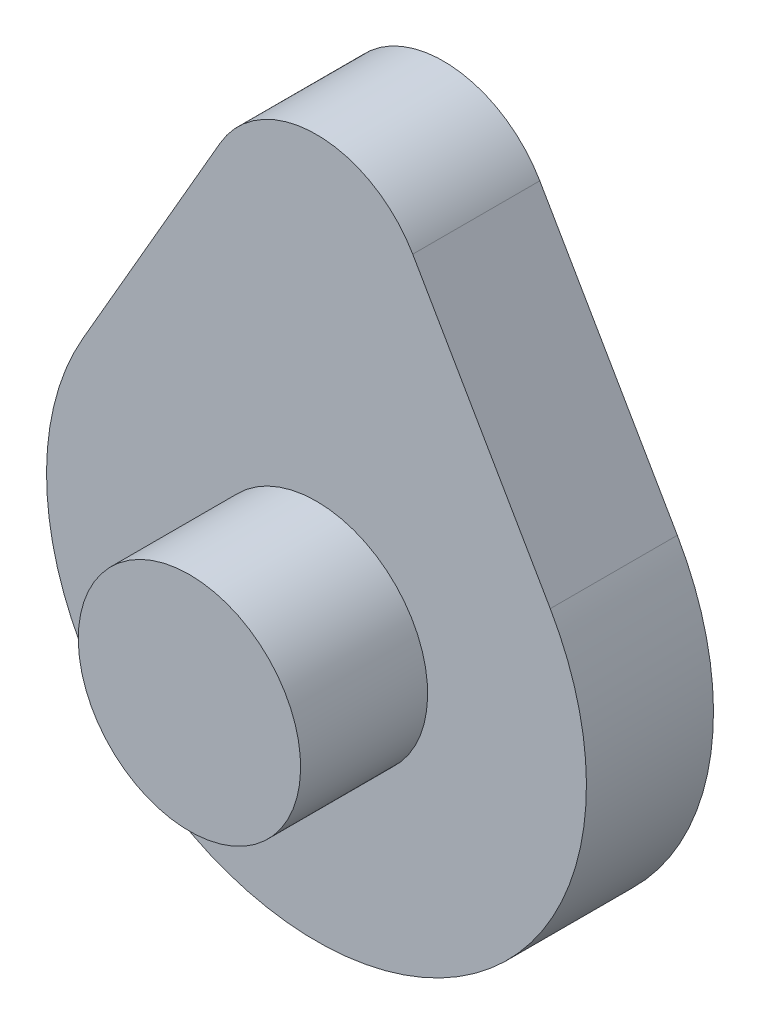
ISO-10303-21;
HEADER;
FILE_DESCRIPTION(('STEP AP214'),'2;1');
FILE_NAME('part.step','',(''),(''),'','','');
FILE_SCHEMA(('AUTOMOTIVE_DESIGN { 1 0 10303 214 1 1 1 1 }'));
ENDSEC;
DATA;
#1=APPLICATION_CONTEXT('core data for automotive mechanical design processes');
#2=APPLICATION_PROTOCOL_DEFINITION('international standard','automotive_design',2000,#1);
#3=PRODUCT_CONTEXT('',#1,'mechanical');
#4=PRODUCT('Part','Part','',(#3));
#5=PRODUCT_RELATED_PRODUCT_CATEGORY('part','',(#4));
#6=PRODUCT_DEFINITION_FORMATION('','',#4);
#7=PRODUCT_DEFINITION_CONTEXT('part definition',#1,'design');
#8=PRODUCT_DEFINITION('design','',#6,#7);
#9=PRODUCT_DEFINITION_SHAPE('','',#8);
#10=(LENGTH_UNIT() NAMED_UNIT(*) SI_UNIT(.MILLI.,.METRE.));
#11=(NAMED_UNIT(*) PLANE_ANGLE_UNIT() SI_UNIT($,.RADIAN.));
#12=(NAMED_UNIT(*) SI_UNIT($,.STERADIAN.) SOLID_ANGLE_UNIT());
#13=UNCERTAINTY_MEASURE_WITH_UNIT(LENGTH_MEASURE(1.E-05),#10,'distance_accuracy_value','');
#14=(GEOMETRIC_REPRESENTATION_CONTEXT(3) GLOBAL_UNCERTAINTY_ASSIGNED_CONTEXT((#13)) GLOBAL_UNIT_ASSIGNED_CONTEXT((#10,
#11,#12)) REPRESENTATION_CONTEXT('',''));
#15=CARTESIAN_POINT('',(0.,0.,0.));
#16=DIRECTION('',(0.,0.,1.));
#17=DIRECTION('',(1.,0.,0.));
#18=AXIS2_PLACEMENT_3D('',#15,#16,#17);
#19=CARTESIAN_POINT('',(-43.01,-43.16,0.));
#20=DIRECTION('',(0.,0.,1.));
#21=DIRECTION('',(1.,0.,0.));
#22=AXIS2_PLACEMENT_3D('',#19,#20,#21);
#23=PLANE('',#22);
#24=DIRECTION('',(0.500000000006738,0.866025403780548,0.));
#25=VECTOR('',#24,1.);
#26=CARTESIAN_POINT('',(-25.9807621135,40.,0.));
#27=LINE('',#26,#25);
#28=CARTESIAN_POINT('',(-36.8060796608972,21.2500000001781,0.));
#29=VERTEX_POINT('',#28);
#30=CARTESIAN_POINT('',(-15.1554445659944,58.7500000000097,0.));
#31=VERTEX_POINT('',#30);
#32=EDGE_CURVE('E81',#29,#31,#27,.T.);
#33=ORIENTED_EDGE('',*,*,#32,.T.);
#34=CARTESIAN_POINT('',(0.,50.,0.));
#35=DIRECTION('',(0.,0.,-1.));
#36=DIRECTION('',(0.,1.,0.));
#37=AXIS2_PLACEMENT_3D('',#34,#35,#36);
#38=CIRCLE('',#37,17.5);
#39=CARTESIAN_POINT('',(15.1554445661455,58.7499999999452,0.));
#40=VERTEX_POINT('',#39);
#41=EDGE_CURVE('E68',#31,#40,#38,.T.);
#42=ORIENTED_EDGE('',*,*,#41,.T.);
#43=DIRECTION('',(0.500000000006738,-0.866025403780548,0.));
#44=VECTOR('',#43,1.);
#45=CARTESIAN_POINT('',(25.9807621135,40.,0.));
#46=LINE('',#45,#44);
#47=CARTESIAN_POINT('',(36.8060796608972,21.2500000001781,0.));
#48=VERTEX_POINT('',#47);
#49=EDGE_CURVE('E67',#40,#48,#46,.T.);
#50=ORIENTED_EDGE('',*,*,#49,.T.);
#51=CARTESIAN_POINT('',(0.,0.,0.));
#52=DIRECTION('',(0.,0.,-1.));
#53=DIRECTION('',(0.,1.,0.));
#54=AXIS2_PLACEMENT_3D('',#51,#52,#53);
#55=CIRCLE('',#54,42.5);
#56=EDGE_CURVE('E21',#48,#29,#55,.T.);
#57=ORIENTED_EDGE('',*,*,#56,.T.);
#58=EDGE_LOOP('',(#33,#42,#50,#57));
#59=FACE_BOUND('',#58,.T.);
#60=ADVANCED_FACE('F17',(#59),#23,.F.);
#61=CARTESIAN_POINT('',(0.,0.,20.));
#62=DIRECTION('',(0.,0.,-1.));
#63=DIRECTION('',(0.,1.,0.));
#64=AXIS2_PLACEMENT_3D('',#61,#62,#63);
#65=CYLINDRICAL_SURFACE('',#64,42.5);
#66=CARTESIAN_POINT('',(0.,0.,20.));
#67=DIRECTION('',(0.,0.,-1.));
#68=DIRECTION('',(0.,1.,0.));
#69=AXIS2_PLACEMENT_3D('',#66,#67,#68);
#70=CIRCLE('',#69,42.5);
#71=CARTESIAN_POINT('',(-36.8060796521262,21.2500000312885,20.));
#72=VERTEX_POINT('',#71);
#73=CARTESIAN_POINT('',(36.8060796521262,21.2500000312885,20.));
#74=VERTEX_POINT('',#73);
#75=EDGE_CURVE('E82',#72,#74,#70,.F.);
#76=ORIENTED_EDGE('',*,*,#75,.F.);
#77=DIRECTION('',(0.,0.,-1.));
#78=VECTOR('',#77,1.);
#79=CARTESIAN_POINT('',(-36.806079661,21.25,10.));
#80=LINE('',#79,#78);
#81=EDGE_CURVE('E62',#72,#29,#80,.T.);
#82=ORIENTED_EDGE('',*,*,#81,.T.);
#83=ORIENTED_EDGE('',*,*,#56,.F.);
#84=DIRECTION('',(0.,0.,1.));
#85=VECTOR('',#84,1.);
#86=CARTESIAN_POINT('',(36.806079661,21.25,10.));
#87=LINE('',#86,#85);
#88=EDGE_CURVE('E59',#48,#74,#87,.T.);
#89=ORIENTED_EDGE('',*,*,#88,.T.);
#90=EDGE_LOOP('',(#76,#82,#83,#89));
#91=FACE_BOUND('',#90,.T.);
#92=ADVANCED_FACE('F57',(#91),#65,.T.);
#93=CARTESIAN_POINT('',(15.155444566,58.75,0.));
#94=DIRECTION('',(-0.866025403780548,-0.500000000006738,0.));
#95=DIRECTION('',(0.500000000006738,-0.866025403780548,0.));
#96=AXIS2_PLACEMENT_3D('',#93,#94,#95);
#97=PLANE('',#96);
#98=DIRECTION('',(0.,0.,-1.));
#99=VECTOR('',#98,1.);
#100=CARTESIAN_POINT('',(15.1554445663021,58.7499999998711,10.));
#101=LINE('',#100,#99);
#102=CARTESIAN_POINT('',(15.1554445389464,58.7499999991371,20.));
#103=VERTEX_POINT('',#102);
#104=EDGE_CURVE('E71',#40,#103,#101,.F.);
#105=ORIENTED_EDGE('',*,*,#104,.T.);
#106=DIRECTION('',(-0.500000001283478,0.866025403043422,0.));
#107=VECTOR('',#106,1.);
#108=CARTESIAN_POINT('',(36.80607966728,21.25000002096,20.));
#109=LINE('',#108,#107);
#110=EDGE_CURVE('E75',#74,#103,#109,.T.);
#111=ORIENTED_EDGE('',*,*,#110,.F.);
#112=ORIENTED_EDGE('',*,*,#88,.F.);
#113=ORIENTED_EDGE('',*,*,#49,.F.);
#114=EDGE_LOOP('',(#105,#111,#112,#113));
#115=FACE_BOUND('',#114,.T.);
#116=ADVANCED_FACE('F73',(#115),#97,.F.);
#117=CARTESIAN_POINT('',(0.,50.,20.));
#118=DIRECTION('',(0.,0.,-1.));
#119=DIRECTION('',(0.,1.,0.));
#120=AXIS2_PLACEMENT_3D('',#117,#118,#119);
#121=CYLINDRICAL_SURFACE('',#120,17.5);
#122=DIRECTION('',(0.,0.,1.));
#123=VECTOR('',#122,1.);
#124=CARTESIAN_POINT('',(-15.155444566,58.75,10.));
#125=LINE('',#124,#123);
#126=CARTESIAN_POINT('',(-15.1554445387953,58.7499999992015,20.));
#127=VERTEX_POINT('',#126);
#128=EDGE_CURVE('E36',#31,#127,#125,.T.);
#129=ORIENTED_EDGE('',*,*,#128,.T.);
#130=CARTESIAN_POINT('',(0.,50.,20.));
#131=DIRECTION('',(0.,0.,-1.));
#132=DIRECTION('',(0.,1.,0.));
#133=AXIS2_PLACEMENT_3D('',#130,#131,#132);
#134=CIRCLE('',#133,17.5);
#135=EDGE_CURVE('E89',#103,#127,#134,.F.);
#136=ORIENTED_EDGE('',*,*,#135,.F.);
#137=ORIENTED_EDGE('',*,*,#104,.F.);
#138=ORIENTED_EDGE('',*,*,#41,.F.);
#139=EDGE_LOOP('',(#129,#136,#137,#138));
#140=FACE_BOUND('',#139,.T.);
#141=ADVANCED_FACE('F94',(#140),#121,.T.);
#142=CARTESIAN_POINT('',(-36.806079661,21.25,0.));
#143=DIRECTION('',(0.866025403780548,-0.500000000006738,0.));
#144=DIRECTION('',(0.500000000006738,0.866025403780548,0.));
#145=AXIS2_PLACEMENT_3D('',#142,#143,#144);
#146=PLANE('',#145);
#147=ORIENTED_EDGE('',*,*,#81,.F.);
#148=DIRECTION('',(-0.500000001283479,-0.866025403043422,0.));
#149=VECTOR('',#148,1.);
#150=CARTESIAN_POINT('',(-15.15544453852,58.74999995176,20.));
#151=LINE('',#150,#149);
#152=EDGE_CURVE('E86',#127,#72,#151,.T.);
#153=ORIENTED_EDGE('',*,*,#152,.F.);
#154=ORIENTED_EDGE('',*,*,#128,.F.);
#155=ORIENTED_EDGE('',*,*,#32,.F.);
#156=EDGE_LOOP('',(#147,#153,#154,#155));
#157=FACE_BOUND('',#156,.T.);
#158=ADVANCED_FACE('F98',(#157),#146,.F.);
#159=CARTESIAN_POINT('',(-43.01,-43.16,20.));
#160=DIRECTION('',(0.,0.,1.));
#161=DIRECTION('',(1.,0.,0.));
#162=AXIS2_PLACEMENT_3D('',#159,#160,#161);
#163=PLANE('',#162);
#164=CARTESIAN_POINT('',(0.,0.,20.));
#165=DIRECTION('',(0.,0.,-1.));
#166=DIRECTION('',(0.,1.,0.));
#167=AXIS2_PLACEMENT_3D('',#164,#165,#166);
#168=CIRCLE('',#167,17.5);
#169=CARTESIAN_POINT('',(0.,17.5,20.));
#170=VERTEX_POINT('',#169);
#171=EDGE_CURVE('E27',#170,#170,#168,.T.);
#172=ORIENTED_EDGE('',*,*,#171,.T.);
#173=EDGE_LOOP('',(#172));
#174=FACE_BOUND('',#173,.T.);
#175=ORIENTED_EDGE('',*,*,#135,.T.);
#176=ORIENTED_EDGE('',*,*,#152,.T.);
#177=ORIENTED_EDGE('',*,*,#75,.T.);
#178=ORIENTED_EDGE('',*,*,#110,.T.);
#179=EDGE_LOOP('',(#175,#176,#177,#178));
#180=FACE_BOUND('',#179,.T.);
#181=ADVANCED_FACE('F96',(#174,#180),#163,.T.);
#182=CARTESIAN_POINT('',(-17.71,-17.71,40.));
#183=DIRECTION('',(0.,0.,1.));
#184=DIRECTION('',(1.,0.,0.));
#185=AXIS2_PLACEMENT_3D('',#182,#183,#184);
#186=PLANE('',#185);
#187=CARTESIAN_POINT('',(0.,0.,40.));
#188=DIRECTION('',(0.,0.,-1.));
#189=DIRECTION('',(0.,1.,0.));
#190=AXIS2_PLACEMENT_3D('',#187,#188,#189);
#191=CIRCLE('',#190,17.5);
#192=CARTESIAN_POINT('',(0.,17.5,40.));
#193=VERTEX_POINT('',#192);
#194=EDGE_CURVE('E11',#193,#193,#191,.F.);
#195=ORIENTED_EDGE('',*,*,#194,.T.);
#196=EDGE_LOOP('',(#195));
#197=FACE_BOUND('',#196,.T.);
#198=ADVANCED_FACE('F19',(#197),#186,.T.);
#199=CARTESIAN_POINT('',(0.,0.,40.));
#200=DIRECTION('',(0.,0.,-1.));
#201=DIRECTION('',(0.,1.,0.));
#202=AXIS2_PLACEMENT_3D('',#199,#200,#201);
#203=CYLINDRICAL_SURFACE('',#202,17.5);
#204=ORIENTED_EDGE('',*,*,#171,.F.);
#205=EDGE_LOOP('',(#204));
#206=FACE_BOUND('',#205,.T.);
#207=ORIENTED_EDGE('',*,*,#194,.F.);
#208=EDGE_LOOP('',(#207));
#209=FACE_BOUND('',#208,.T.);
#210=ADVANCED_FACE('F109',(#206,#209),#203,.T.);
#211=CLOSED_SHELL('',(#60,#92,#116,#141,#158,#181,#198,#210));
#212=MANIFOLD_SOLID_BREP('B1',#211);
#213=ADVANCED_BREP_SHAPE_REPRESENTATION('',(#18,#212),#14);
#214=SHAPE_DEFINITION_REPRESENTATION(#9,#213);
ENDSEC;
END-ISO-10303-21;
